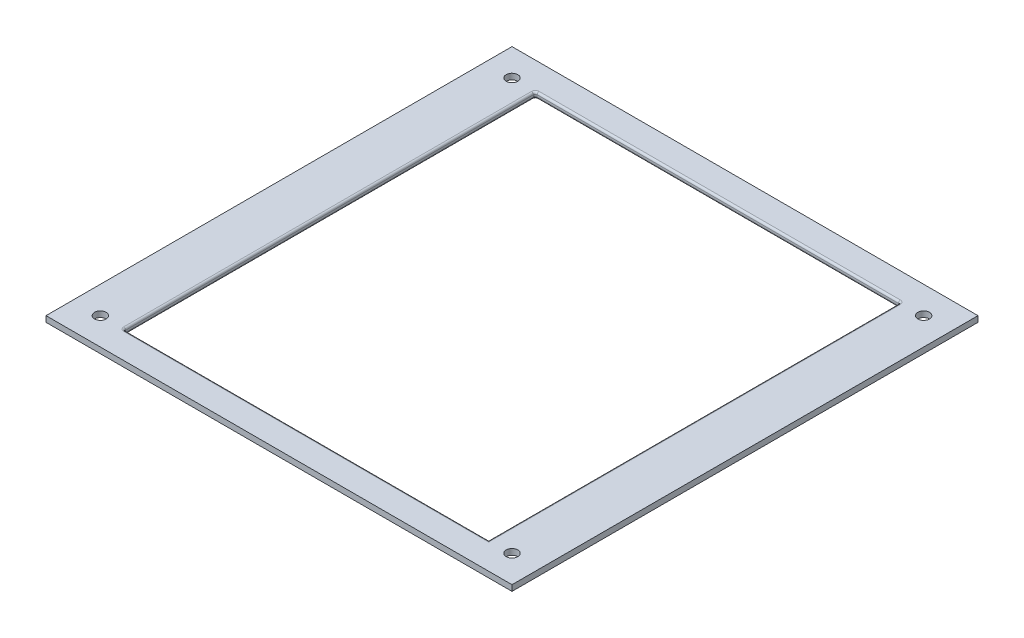
ISO-10303-21;
HEADER;
FILE_DESCRIPTION(('STEP AP214'),'2;1');
FILE_NAME('part.step','',(''),(''),'','','');
FILE_SCHEMA(('AUTOMOTIVE_DESIGN { 1 0 10303 214 1 1 1 1 }'));
ENDSEC;
DATA;
#1=APPLICATION_CONTEXT('core data for automotive mechanical design processes');
#2=APPLICATION_PROTOCOL_DEFINITION('international standard','automotive_design',2000,#1);
#3=PRODUCT_CONTEXT('',#1,'mechanical');
#4=PRODUCT('Part','Part','',(#3));
#5=PRODUCT_RELATED_PRODUCT_CATEGORY('part','',(#4));
#6=PRODUCT_DEFINITION_FORMATION('','',#4);
#7=PRODUCT_DEFINITION_CONTEXT('part definition',#1,'design');
#8=PRODUCT_DEFINITION('design','',#6,#7);
#9=PRODUCT_DEFINITION_SHAPE('','',#8);
#10=(LENGTH_UNIT() NAMED_UNIT(*) SI_UNIT(.MILLI.,.METRE.));
#11=(NAMED_UNIT(*) PLANE_ANGLE_UNIT() SI_UNIT($,.RADIAN.));
#12=(NAMED_UNIT(*) SI_UNIT($,.STERADIAN.) SOLID_ANGLE_UNIT());
#13=UNCERTAINTY_MEASURE_WITH_UNIT(LENGTH_MEASURE(1.E-05),#10,'distance_accuracy_value','');
#14=(GEOMETRIC_REPRESENTATION_CONTEXT(3) GLOBAL_UNCERTAINTY_ASSIGNED_CONTEXT((#13)) GLOBAL_UNIT_ASSIGNED_CONTEXT((#10,
#11,#12)) REPRESENTATION_CONTEXT('',''));
#15=CARTESIAN_POINT('',(0.,0.,0.));
#16=DIRECTION('',(0.,0.,1.));
#17=DIRECTION('',(1.,0.,0.));
#18=AXIS2_PLACEMENT_3D('',#15,#16,#17);
#19=CARTESIAN_POINT('',(0.,0.,0.));
#20=DIRECTION('',(0.,-1.,0.));
#21=DIRECTION('',(0.,0.,-1.));
#22=AXIS2_PLACEMENT_3D('',#19,#20,#21);
#23=PLANE('',#22);
#24=CARTESIAN_POINT('',(52.9999999999986,0.,-52.9999999999986));
#25=DIRECTION('',(0.,1.,0.));
#26=DIRECTION('',(0.,0.,1.));
#27=AXIS2_PLACEMENT_3D('',#24,#25,#26);
#28=CIRCLE('',#27,1.5);
#29=CARTESIAN_POINT('',(52.9999999999986,0.,-51.4999999999986));
#30=VERTEX_POINT('',#29);
#31=EDGE_CURVE('E322',#30,#30,#28,.T.);
#32=ORIENTED_EDGE('',*,*,#31,.T.);
#33=EDGE_LOOP('',(#32));
#34=FACE_BOUND('',#33,.T.);
#35=CARTESIAN_POINT('',(-52.9999999999702,0.,53.0000000000271));
#36=DIRECTION('',(0.,1.,0.));
#37=DIRECTION('',(0.,0.,1.));
#38=AXIS2_PLACEMENT_3D('',#35,#36,#37);
#39=CIRCLE('',#38,1.5);
#40=CARTESIAN_POINT('',(-52.9999999999702,0.,54.5000000000271));
#41=VERTEX_POINT('',#40);
#42=EDGE_CURVE('E321',#41,#41,#39,.T.);
#43=ORIENTED_EDGE('',*,*,#42,.T.);
#44=EDGE_LOOP('',(#43));
#45=FACE_BOUND('',#44,.T.);
#46=CARTESIAN_POINT('',(52.9999999999986,0.,52.9999999999986));
#47=DIRECTION('',(0.,1.,0.));
#48=DIRECTION('',(0.,0.,1.));
#49=AXIS2_PLACEMENT_3D('',#46,#47,#48);
#50=CIRCLE('',#49,1.5);
#51=CARTESIAN_POINT('',(52.9999999999986,0.,54.4999999999986));
#52=VERTEX_POINT('',#51);
#53=EDGE_CURVE('E310',#52,#52,#50,.T.);
#54=ORIENTED_EDGE('',*,*,#53,.T.);
#55=EDGE_LOOP('',(#54));
#56=FACE_BOUND('',#55,.T.);
#57=CARTESIAN_POINT('',(-52.9999999999986,0.,-52.9999999999986));
#58=DIRECTION('',(0.,1.,0.));
#59=DIRECTION('',(0.,0.,1.));
#60=AXIS2_PLACEMENT_3D('',#57,#58,#59);
#61=CIRCLE('',#60,1.5);
#62=CARTESIAN_POINT('',(-52.9999999999986,0.,-51.4999999999986));
#63=VERTEX_POINT('',#62);
#64=EDGE_CURVE('E329',#63,#63,#61,.T.);
#65=ORIENTED_EDGE('',*,*,#64,.T.);
#66=EDGE_LOOP('',(#65));
#67=FACE_BOUND('',#66,.T.);
#68=DIRECTION('',(0.,0.,-1.));
#69=VECTOR('',#68,1.);
#70=CARTESIAN_POINT('',(60.,0.,60.));
#71=LINE('',#70,#69);
#72=CARTESIAN_POINT('',(60.,0.,60.));
#73=VERTEX_POINT('',#72);
#74=CARTESIAN_POINT('',(60.,0.,-60.));
#75=VERTEX_POINT('',#74);
#76=EDGE_CURVE('E183',#73,#75,#71,.T.);
#77=ORIENTED_EDGE('',*,*,#76,.F.);
#78=DIRECTION('',(1.,0.,0.));
#79=VECTOR('',#78,1.);
#80=CARTESIAN_POINT('',(-60.,0.,60.));
#81=LINE('',#80,#79);
#82=CARTESIAN_POINT('',(-60.,0.,60.));
#83=VERTEX_POINT('',#82);
#84=EDGE_CURVE('E179',#83,#73,#81,.T.);
#85=ORIENTED_EDGE('',*,*,#84,.F.);
#86=DIRECTION('',(0.,0.,1.));
#87=VECTOR('',#86,1.);
#88=CARTESIAN_POINT('',(-60.,0.,60.));
#89=LINE('',#88,#87);
#90=CARTESIAN_POINT('',(-60.,0.,-60.));
#91=VERTEX_POINT('',#90);
#92=EDGE_CURVE('E345',#91,#83,#89,.T.);
#93=ORIENTED_EDGE('',*,*,#92,.F.);
#94=DIRECTION('',(-1.,0.,0.));
#95=VECTOR('',#94,1.);
#96=CARTESIAN_POINT('',(-60.,0.,-60.));
#97=LINE('',#96,#95);
#98=EDGE_CURVE('E343',#75,#91,#97,.T.);
#99=ORIENTED_EDGE('',*,*,#98,.F.);
#100=EDGE_LOOP('',(#77,#85,#93,#99));
#101=FACE_BOUND('',#100,.T.);
#102=CARTESIAN_POINT('',(-46.5,0.,52.5));
#103=DIRECTION('',(0.,-1.,0.));
#104=DIRECTION('',(0.,0.,-1.));
#105=AXIS2_PLACEMENT_3D('',#102,#103,#104);
#106=CIRCLE('',#105,1.);
#107=CARTESIAN_POINT('',(-46.5,0.,53.5));
#108=VERTEX_POINT('',#107);
#109=CARTESIAN_POINT('',(-47.5,0.,52.5));
#110=VERTEX_POINT('',#109);
#111=EDGE_CURVE('E229',#108,#110,#106,.T.);
#112=ORIENTED_EDGE('',*,*,#111,.F.);
#113=DIRECTION('',(1.,0.,0.));
#114=VECTOR('',#113,1.);
#115=CARTESIAN_POINT('',(0.,0.,53.5));
#116=LINE('',#115,#114);
#117=CARTESIAN_POINT('',(47.499999999997,0.,53.5));
#118=VERTEX_POINT('',#117);
#119=EDGE_CURVE('E226',#108,#118,#116,.T.);
#120=ORIENTED_EDGE('',*,*,#119,.T.);
#121=DIRECTION('',(0.,0.,-1.));
#122=VECTOR('',#121,1.);
#123=CARTESIAN_POINT('',(47.4999999999985,0.,1.32460866175055E-12));
#124=LINE('',#123,#122);
#125=CARTESIAN_POINT('',(47.5,0.,-52.5));
#126=VERTEX_POINT('',#125);
#127=EDGE_CURVE('E224',#118,#126,#124,.T.);
#128=ORIENTED_EDGE('',*,*,#127,.T.);
#129=CARTESIAN_POINT('',(46.5,0.,-52.5));
#130=DIRECTION('',(0.,-1.,0.));
#131=DIRECTION('',(0.,0.,-1.));
#132=AXIS2_PLACEMENT_3D('',#129,#130,#131);
#133=CIRCLE('',#132,1.);
#134=CARTESIAN_POINT('',(46.5,0.,-53.5));
#135=VERTEX_POINT('',#134);
#136=EDGE_CURVE('E221',#135,#126,#133,.T.);
#137=ORIENTED_EDGE('',*,*,#136,.F.);
#138=DIRECTION('',(-1.,0.,0.));
#139=VECTOR('',#138,1.);
#140=CARTESIAN_POINT('',(0.,0.,-53.5));
#141=LINE('',#140,#139);
#142=CARTESIAN_POINT('',(-46.4999999999971,0.,-53.5));
#143=VERTEX_POINT('',#142);
#144=EDGE_CURVE('E217',#135,#143,#141,.T.);
#145=ORIENTED_EDGE('',*,*,#144,.T.);
#146=CARTESIAN_POINT('',(-46.4999999999971,0.,-52.5));
#147=DIRECTION('',(0.,-1.,0.));
#148=DIRECTION('',(0.,0.,-1.));
#149=AXIS2_PLACEMENT_3D('',#146,#147,#148);
#150=CIRCLE('',#149,1.);
#151=CARTESIAN_POINT('',(-47.4999999999971,0.,-52.5));
#152=VERTEX_POINT('',#151);
#153=EDGE_CURVE('E214',#152,#143,#150,.T.);
#154=ORIENTED_EDGE('',*,*,#153,.F.);
#155=DIRECTION('',(0.,0.,1.));
#156=VECTOR('',#155,1.);
#157=CARTESIAN_POINT('',(-47.4999999999985,0.,-1.31838984174233E-12));
#158=LINE('',#157,#156);
#159=EDGE_CURVE('E219',#152,#110,#158,.T.);
#160=ORIENTED_EDGE('',*,*,#159,.T.);
#161=EDGE_LOOP('',(#112,#120,#128,#137,#145,#154,#160));
#162=FACE_BOUND('',#161,.T.);
#163=ADVANCED_FACE('F33',(#34,#45,#56,#67,#101,#162),#23,.T.);
#164=CARTESIAN_POINT('',(0.,1.5,0.));
#165=DIRECTION('',(0.,-1.,0.));
#166=DIRECTION('',(0.,0.,-1.));
#167=AXIS2_PLACEMENT_3D('',#164,#165,#166);
#168=PLANE('',#167);
#169=DIRECTION('',(0.,0.,1.));
#170=VECTOR('',#169,1.);
#171=CARTESIAN_POINT('',(47.499999999997,1.5,53.));
#172=LINE('',#171,#170);
#173=CARTESIAN_POINT('',(47.5,1.5,-52.5));
#174=VERTEX_POINT('',#173);
#175=CARTESIAN_POINT('',(47.499999999997,1.5,53.5));
#176=VERTEX_POINT('',#175);
#177=EDGE_CURVE('E199',#174,#176,#172,.T.);
#178=ORIENTED_EDGE('',*,*,#177,.T.);
#179=DIRECTION('',(-1.,0.,0.));
#180=VECTOR('',#179,1.);
#181=CARTESIAN_POINT('',(-47.,1.5,53.5));
#182=LINE('',#181,#180);
#183=CARTESIAN_POINT('',(-46.5,1.5,53.5));
#184=VERTEX_POINT('',#183);
#185=EDGE_CURVE('E204',#176,#184,#182,.T.);
#186=ORIENTED_EDGE('',*,*,#185,.T.);
#187=CARTESIAN_POINT('',(-46.5,1.5,52.5));
#188=DIRECTION('',(0.,-1.,0.));
#189=DIRECTION('',(0.,0.,-1.));
#190=AXIS2_PLACEMENT_3D('',#187,#188,#189);
#191=CIRCLE('',#190,1.);
#192=CARTESIAN_POINT('',(-47.5,1.5,52.5));
#193=VERTEX_POINT('',#192);
#194=EDGE_CURVE('E201',#193,#184,#191,.F.);
#195=ORIENTED_EDGE('',*,*,#194,.F.);
#196=DIRECTION('',(0.,0.,-1.));
#197=VECTOR('',#196,1.);
#198=CARTESIAN_POINT('',(-47.499999999997,1.5,-53.));
#199=LINE('',#198,#197);
#200=CARTESIAN_POINT('',(-47.4999999999971,1.5,-52.5));
#201=VERTEX_POINT('',#200);
#202=EDGE_CURVE('E197',#193,#201,#199,.T.);
#203=ORIENTED_EDGE('',*,*,#202,.T.);
#204=CARTESIAN_POINT('',(-46.4999999999971,1.5,-52.5));
#205=DIRECTION('',(0.,-1.,0.));
#206=DIRECTION('',(0.,0.,-1.));
#207=AXIS2_PLACEMENT_3D('',#204,#205,#206);
#208=CIRCLE('',#207,1.);
#209=CARTESIAN_POINT('',(-46.4999999999971,1.5,-53.5));
#210=VERTEX_POINT('',#209);
#211=EDGE_CURVE('E194',#210,#201,#208,.F.);
#212=ORIENTED_EDGE('',*,*,#211,.F.);
#213=DIRECTION('',(1.,0.,0.));
#214=VECTOR('',#213,1.);
#215=CARTESIAN_POINT('',(47.,1.5,-53.5));
#216=LINE('',#215,#214);
#217=CARTESIAN_POINT('',(46.5,1.5,-53.5));
#218=VERTEX_POINT('',#217);
#219=EDGE_CURVE('E187',#210,#218,#216,.T.);
#220=ORIENTED_EDGE('',*,*,#219,.T.);
#221=CARTESIAN_POINT('',(46.5,1.5,-52.5));
#222=DIRECTION('',(0.,-1.,0.));
#223=DIRECTION('',(0.,0.,-1.));
#224=AXIS2_PLACEMENT_3D('',#221,#222,#223);
#225=CIRCLE('',#224,1.);
#226=EDGE_CURVE('E184',#174,#218,#225,.F.);
#227=ORIENTED_EDGE('',*,*,#226,.F.);
#228=EDGE_LOOP('',(#178,#186,#195,#203,#212,#220,#227));
#229=FACE_BOUND('',#228,.T.);
#230=DIRECTION('',(0.,0.,-1.));
#231=VECTOR('',#230,1.);
#232=CARTESIAN_POINT('',(60.,1.5,60.));
#233=LINE('',#232,#231);
#234=CARTESIAN_POINT('',(60.,1.5,60.));
#235=VERTEX_POINT('',#234);
#236=CARTESIAN_POINT('',(60.,1.5,-60.));
#237=VERTEX_POINT('',#236);
#238=EDGE_CURVE('E169',#235,#237,#233,.T.);
#239=ORIENTED_EDGE('',*,*,#238,.T.);
#240=DIRECTION('',(-1.,0.,0.));
#241=VECTOR('',#240,1.);
#242=CARTESIAN_POINT('',(-60.,1.5,-60.));
#243=LINE('',#242,#241);
#244=CARTESIAN_POINT('',(-60.,1.5,-60.));
#245=VERTEX_POINT('',#244);
#246=EDGE_CURVE('E158',#237,#245,#243,.T.);
#247=ORIENTED_EDGE('',*,*,#246,.T.);
#248=DIRECTION('',(0.,0.,1.));
#249=VECTOR('',#248,1.);
#250=CARTESIAN_POINT('',(-60.,1.5,60.));
#251=LINE('',#250,#249);
#252=CARTESIAN_POINT('',(-60.,1.5,60.));
#253=VERTEX_POINT('',#252);
#254=EDGE_CURVE('E168',#245,#253,#251,.T.);
#255=ORIENTED_EDGE('',*,*,#254,.T.);
#256=DIRECTION('',(1.,0.,0.));
#257=VECTOR('',#256,1.);
#258=CARTESIAN_POINT('',(-60.,1.5,60.));
#259=LINE('',#258,#257);
#260=EDGE_CURVE('E175',#253,#235,#259,.T.);
#261=ORIENTED_EDGE('',*,*,#260,.T.);
#262=EDGE_LOOP('',(#239,#247,#255,#261));
#263=FACE_BOUND('',#262,.T.);
#264=CARTESIAN_POINT('',(-52.9999999999986,1.5,-52.9999999999986));
#265=DIRECTION('',(0.,-1.,0.));
#266=DIRECTION('',(0.,0.,-1.));
#267=AXIS2_PLACEMENT_3D('',#264,#265,#266);
#268=CIRCLE('',#267,1.5);
#269=CARTESIAN_POINT('',(-52.9999999999986,1.5,-54.4999999999986));
#270=VERTEX_POINT('',#269);
#271=EDGE_CURVE('E336',#270,#270,#268,.T.);
#272=ORIENTED_EDGE('',*,*,#271,.T.);
#273=EDGE_LOOP('',(#272));
#274=FACE_BOUND('',#273,.T.);
#275=CARTESIAN_POINT('',(52.9999999999986,1.5,52.9999999999986));
#276=DIRECTION('',(0.,-1.,0.));
#277=DIRECTION('',(0.,0.,-1.));
#278=AXIS2_PLACEMENT_3D('',#275,#276,#277);
#279=CIRCLE('',#278,1.5);
#280=CARTESIAN_POINT('',(52.9999999999986,1.5,51.4999999999986));
#281=VERTEX_POINT('',#280);
#282=EDGE_CURVE('E316',#281,#281,#279,.T.);
#283=ORIENTED_EDGE('',*,*,#282,.T.);
#284=EDGE_LOOP('',(#283));
#285=FACE_BOUND('',#284,.T.);
#286=CARTESIAN_POINT('',(-52.9999999999702,1.5,53.0000000000271));
#287=DIRECTION('',(0.,-1.,0.));
#288=DIRECTION('',(0.,0.,-1.));
#289=AXIS2_PLACEMENT_3D('',#286,#287,#288);
#290=CIRCLE('',#289,1.5);
#291=CARTESIAN_POINT('',(-52.9999999999702,1.5,51.5000000000271));
#292=VERTEX_POINT('',#291);
#293=EDGE_CURVE('E326',#292,#292,#290,.T.);
#294=ORIENTED_EDGE('',*,*,#293,.T.);
#295=EDGE_LOOP('',(#294));
#296=FACE_BOUND('',#295,.T.);
#297=CARTESIAN_POINT('',(52.9999999999986,1.5,-52.9999999999986));
#298=DIRECTION('',(0.,-1.,0.));
#299=DIRECTION('',(0.,0.,-1.));
#300=AXIS2_PLACEMENT_3D('',#297,#298,#299);
#301=CIRCLE('',#300,1.5);
#302=CARTESIAN_POINT('',(52.9999999999986,1.5,-54.4999999999986));
#303=VERTEX_POINT('',#302);
#304=EDGE_CURVE('E325',#303,#303,#301,.T.);
#305=ORIENTED_EDGE('',*,*,#304,.T.);
#306=EDGE_LOOP('',(#305));
#307=FACE_BOUND('',#306,.T.);
#308=ADVANCED_FACE('F172',(#229,#263,#274,#285,#296,#307),#168,.F.);
#309=CARTESIAN_POINT('',(60.,1.5,60.));
#310=DIRECTION('',(-1.,0.,0.));
#311=DIRECTION('',(0.,0.,1.));
#312=AXIS2_PLACEMENT_3D('',#309,#310,#311);
#313=PLANE('',#312);
#314=ORIENTED_EDGE('',*,*,#76,.T.);
#315=DIRECTION('',(0.,-1.,0.));
#316=VECTOR('',#315,1.);
#317=CARTESIAN_POINT('',(60.,1.5,-60.));
#318=LINE('',#317,#316);
#319=EDGE_CURVE('E162',#237,#75,#318,.T.);
#320=ORIENTED_EDGE('',*,*,#319,.F.);
#321=ORIENTED_EDGE('',*,*,#238,.F.);
#322=DIRECTION('',(0.,-1.,0.));
#323=VECTOR('',#322,1.);
#324=CARTESIAN_POINT('',(60.,1.5,60.));
#325=LINE('',#324,#323);
#326=EDGE_CURVE('E341',#235,#73,#325,.T.);
#327=ORIENTED_EDGE('',*,*,#326,.T.);
#328=EDGE_LOOP('',(#314,#320,#321,#327));
#329=FACE_BOUND('',#328,.T.);
#330=ADVANCED_FACE('F181',(#329),#313,.F.);
#331=CARTESIAN_POINT('',(-60.,1.5,-60.));
#332=DIRECTION('',(0.,0.,1.));
#333=DIRECTION('',(1.,0.,0.));
#334=AXIS2_PLACEMENT_3D('',#331,#332,#333);
#335=PLANE('',#334);
#336=ORIENTED_EDGE('',*,*,#98,.T.);
#337=DIRECTION('',(0.,-1.,0.));
#338=VECTOR('',#337,1.);
#339=CARTESIAN_POINT('',(-60.,1.5,-60.));
#340=LINE('',#339,#338);
#341=EDGE_CURVE('E165',#245,#91,#340,.T.);
#342=ORIENTED_EDGE('',*,*,#341,.F.);
#343=ORIENTED_EDGE('',*,*,#246,.F.);
#344=ORIENTED_EDGE('',*,*,#319,.T.);
#345=EDGE_LOOP('',(#336,#342,#343,#344));
#346=FACE_BOUND('',#345,.T.);
#347=ADVANCED_FACE('F160',(#346),#335,.F.);
#348=CARTESIAN_POINT('',(-60.,1.5,60.));
#349=DIRECTION('',(1.,0.,0.));
#350=DIRECTION('',(0.,0.,-1.));
#351=AXIS2_PLACEMENT_3D('',#348,#349,#350);
#352=PLANE('',#351);
#353=ORIENTED_EDGE('',*,*,#92,.T.);
#354=DIRECTION('',(0.,-1.,0.));
#355=VECTOR('',#354,1.);
#356=CARTESIAN_POINT('',(-60.,1.5,60.));
#357=LINE('',#356,#355);
#358=EDGE_CURVE('E189',#253,#83,#357,.T.);
#359=ORIENTED_EDGE('',*,*,#358,.F.);
#360=ORIENTED_EDGE('',*,*,#254,.F.);
#361=ORIENTED_EDGE('',*,*,#341,.T.);
#362=EDGE_LOOP('',(#353,#359,#360,#361));
#363=FACE_BOUND('',#362,.T.);
#364=ADVANCED_FACE('F357',(#363),#352,.F.);
#365=CARTESIAN_POINT('',(-60.,1.5,60.));
#366=DIRECTION('',(0.,0.,-1.));
#367=DIRECTION('',(-1.,0.,0.));
#368=AXIS2_PLACEMENT_3D('',#365,#366,#367);
#369=PLANE('',#368);
#370=ORIENTED_EDGE('',*,*,#84,.T.);
#371=ORIENTED_EDGE('',*,*,#326,.F.);
#372=ORIENTED_EDGE('',*,*,#260,.F.);
#373=ORIENTED_EDGE('',*,*,#358,.T.);
#374=EDGE_LOOP('',(#370,#371,#372,#373));
#375=FACE_BOUND('',#374,.T.);
#376=ADVANCED_FACE('F352',(#375),#369,.F.);
#377=CARTESIAN_POINT('',(-52.9999999999986,5.74264068711929,-52.9999999999986));
#378=DIRECTION('',(0.,-1.,0.));
#379=DIRECTION('',(0.,0.,-1.));
#380=AXIS2_PLACEMENT_3D('',#377,#378,#379);
#381=CYLINDRICAL_SURFACE('',#380,1.5);
#382=ORIENTED_EDGE('',*,*,#271,.F.);
#383=EDGE_LOOP('',(#382));
#384=FACE_BOUND('',#383,.T.);
#385=ORIENTED_EDGE('',*,*,#64,.F.);
#386=EDGE_LOOP('',(#385));
#387=FACE_BOUND('',#386,.T.);
#388=ADVANCED_FACE('F364',(#384,#387),#381,.F.);
#389=CARTESIAN_POINT('',(52.9999999999986,5.74264068711929,52.9999999999986));
#390=DIRECTION('',(0.,-1.,0.));
#391=DIRECTION('',(0.,0.,-1.));
#392=AXIS2_PLACEMENT_3D('',#389,#390,#391);
#393=CYLINDRICAL_SURFACE('',#392,1.5);
#394=ORIENTED_EDGE('',*,*,#282,.F.);
#395=EDGE_LOOP('',(#394));
#396=FACE_BOUND('',#395,.T.);
#397=ORIENTED_EDGE('',*,*,#53,.F.);
#398=EDGE_LOOP('',(#397));
#399=FACE_BOUND('',#398,.T.);
#400=ADVANCED_FACE('F379',(#396,#399),#393,.F.);
#401=CARTESIAN_POINT('',(-52.9999999999702,5.74264068711929,53.0000000000271));
#402=DIRECTION('',(0.,-1.,0.));
#403=DIRECTION('',(0.,0.,-1.));
#404=AXIS2_PLACEMENT_3D('',#401,#402,#403);
#405=CYLINDRICAL_SURFACE('',#404,1.5);
#406=ORIENTED_EDGE('',*,*,#293,.F.);
#407=EDGE_LOOP('',(#406));
#408=FACE_BOUND('',#407,.T.);
#409=ORIENTED_EDGE('',*,*,#42,.F.);
#410=EDGE_LOOP('',(#409));
#411=FACE_BOUND('',#410,.T.);
#412=ADVANCED_FACE('F381',(#408,#411),#405,.F.);
#413=CARTESIAN_POINT('',(52.9999999999986,5.74264068711929,-52.9999999999986));
#414=DIRECTION('',(0.,-1.,0.));
#415=DIRECTION('',(0.,0.,-1.));
#416=AXIS2_PLACEMENT_3D('',#413,#414,#415);
#417=CYLINDRICAL_SURFACE('',#416,1.5);
#418=ORIENTED_EDGE('',*,*,#304,.F.);
#419=EDGE_LOOP('',(#418));
#420=FACE_BOUND('',#419,.T.);
#421=ORIENTED_EDGE('',*,*,#31,.F.);
#422=EDGE_LOOP('',(#421));
#423=FACE_BOUND('',#422,.T.);
#424=ADVANCED_FACE('F384',(#420,#423),#417,.F.);
#425=CARTESIAN_POINT('',(-46.999999999997,143.175685987399,-53.));
#426=DIRECTION('',(0.,0.,1.));
#427=DIRECTION('',(1.,0.,0.));
#428=AXIS2_PLACEMENT_3D('',#425,#426,#427);
#429=PLANE('',#428);
#430=DIRECTION('',(0.,-1.,0.));
#431=VECTOR('',#430,1.);
#432=CARTESIAN_POINT('',(46.5,1.5,-53.));
#433=LINE('',#432,#431);
#434=CARTESIAN_POINT('',(46.5,0.5,-53.));
#435=VERTEX_POINT('',#434);
#436=CARTESIAN_POINT('',(46.5,1.,-53.));
#437=VERTEX_POINT('',#436);
#438=EDGE_CURVE('E42',#435,#437,#433,.F.);
#439=ORIENTED_EDGE('',*,*,#438,.T.);
#440=DIRECTION('',(1.,0.,0.));
#441=VECTOR('',#440,1.);
#442=CARTESIAN_POINT('',(-46.999999999997,1.,-53.));
#443=LINE('',#442,#441);
#444=CARTESIAN_POINT('',(-46.4999999999971,1.,-53.));
#445=VERTEX_POINT('',#444);
#446=EDGE_CURVE('E11',#437,#445,#443,.F.);
#447=ORIENTED_EDGE('',*,*,#446,.T.);
#448=DIRECTION('',(0.,-1.,0.));
#449=VECTOR('',#448,1.);
#450=CARTESIAN_POINT('',(-46.4999999999971,0.,-53.));
#451=LINE('',#450,#449);
#452=CARTESIAN_POINT('',(-46.4999999999971,0.5,-53.));
#453=VERTEX_POINT('',#452);
#454=EDGE_CURVE('E247',#445,#453,#451,.T.);
#455=ORIENTED_EDGE('',*,*,#454,.T.);
#456=DIRECTION('',(-1.,0.,0.));
#457=VECTOR('',#456,1.);
#458=CARTESIAN_POINT('',(-46.999999999997,0.5,-53.));
#459=LINE('',#458,#457);
#460=EDGE_CURVE('E53',#453,#435,#459,.F.);
#461=ORIENTED_EDGE('',*,*,#460,.T.);
#462=EDGE_LOOP('',(#439,#447,#455,#461));
#463=FACE_BOUND('',#462,.T.);
#464=ADVANCED_FACE('F388',(#463),#429,.T.);
#465=CARTESIAN_POINT('',(47.,143.175685987399,-53.));
#466=DIRECTION('',(-1.,0.,0.));
#467=DIRECTION('',(0.,0.,1.));
#468=AXIS2_PLACEMENT_3D('',#465,#466,#467);
#469=PLANE('',#468);
#470=DIRECTION('',(0.,-1.,0.));
#471=VECTOR('',#470,1.);
#472=CARTESIAN_POINT('',(46.999999999997,143.175685987399,53.));
#473=LINE('',#472,#471);
#474=CARTESIAN_POINT('',(46.999999999997,1.,53.));
#475=VERTEX_POINT('',#474);
#476=CARTESIAN_POINT('',(46.999999999997,0.5,53.));
#477=VERTEX_POINT('',#476);
#478=EDGE_CURVE('E305',#475,#477,#473,.T.);
#479=ORIENTED_EDGE('',*,*,#478,.F.);
#480=DIRECTION('',(0.,0.,1.));
#481=VECTOR('',#480,1.);
#482=CARTESIAN_POINT('',(47.,1.,-53.));
#483=LINE('',#482,#481);
#484=CARTESIAN_POINT('',(47.,1.,-52.5));
#485=VERTEX_POINT('',#484);
#486=EDGE_CURVE('E236',#475,#485,#483,.F.);
#487=ORIENTED_EDGE('',*,*,#486,.T.);
#488=DIRECTION('',(0.,-1.,0.));
#489=VECTOR('',#488,1.);
#490=CARTESIAN_POINT('',(47.,0.,-52.5));
#491=LINE('',#490,#489);
#492=CARTESIAN_POINT('',(47.,0.5,-52.5));
#493=VERTEX_POINT('',#492);
#494=EDGE_CURVE('E232',#485,#493,#491,.T.);
#495=ORIENTED_EDGE('',*,*,#494,.T.);
#496=DIRECTION('',(0.,0.,-1.));
#497=VECTOR('',#496,1.);
#498=CARTESIAN_POINT('',(47.,0.5,-53.));
#499=LINE('',#498,#497);
#500=EDGE_CURVE('E234',#493,#477,#499,.F.);
#501=ORIENTED_EDGE('',*,*,#500,.T.);
#502=EDGE_LOOP('',(#479,#487,#495,#501));
#503=FACE_BOUND('',#502,.T.);
#504=ADVANCED_FACE('F400',(#503),#469,.T.);
#505=CARTESIAN_POINT('',(-47.,143.175685987399,53.));
#506=DIRECTION('',(0.,0.,-1.));
#507=DIRECTION('',(-1.,0.,0.));
#508=AXIS2_PLACEMENT_3D('',#505,#506,#507);
#509=PLANE('',#508);
#510=DIRECTION('',(0.,-1.,0.));
#511=VECTOR('',#510,1.);
#512=CARTESIAN_POINT('',(-46.5,1.5,53.));
#513=LINE('',#512,#511);
#514=CARTESIAN_POINT('',(-46.5,0.5,53.));
#515=VERTEX_POINT('',#514);
#516=CARTESIAN_POINT('',(-46.5,1.,53.));
#517=VERTEX_POINT('',#516);
#518=EDGE_CURVE('E207',#515,#517,#513,.F.);
#519=ORIENTED_EDGE('',*,*,#518,.T.);
#520=DIRECTION('',(-1.,0.,0.));
#521=VECTOR('',#520,1.);
#522=CARTESIAN_POINT('',(46.999999999997,1.,53.));
#523=LINE('',#522,#521);
#524=EDGE_CURVE('E211',#517,#475,#523,.F.);
#525=ORIENTED_EDGE('',*,*,#524,.T.);
#526=ORIENTED_EDGE('',*,*,#478,.T.);
#527=DIRECTION('',(1.,0.,0.));
#528=VECTOR('',#527,1.);
#529=CARTESIAN_POINT('',(-47.,0.5,53.));
#530=LINE('',#529,#528);
#531=EDGE_CURVE('E209',#477,#515,#530,.F.);
#532=ORIENTED_EDGE('',*,*,#531,.T.);
#533=EDGE_LOOP('',(#519,#525,#526,#532));
#534=FACE_BOUND('',#533,.T.);
#535=ADVANCED_FACE('F396',(#534),#509,.T.);
#536=CARTESIAN_POINT('',(-46.999999999997,143.175685987399,-53.));
#537=DIRECTION('',(1.,0.,0.));
#538=DIRECTION('',(0.,0.,-1.));
#539=AXIS2_PLACEMENT_3D('',#536,#537,#538);
#540=PLANE('',#539);
#541=DIRECTION('',(0.,0.,-1.));
#542=VECTOR('',#541,1.);
#543=CARTESIAN_POINT('',(-47.,1.,53.));
#544=LINE('',#543,#542);
#545=CARTESIAN_POINT('',(-46.9999999999971,1.,-52.5));
#546=VERTEX_POINT('',#545);
#547=CARTESIAN_POINT('',(-47.,1.,52.5));
#548=VERTEX_POINT('',#547);
#549=EDGE_CURVE('E242',#546,#548,#544,.F.);
#550=ORIENTED_EDGE('',*,*,#549,.T.);
#551=DIRECTION('',(0.,-1.,0.));
#552=VECTOR('',#551,1.);
#553=CARTESIAN_POINT('',(-47.,0.,52.5));
#554=LINE('',#553,#552);
#555=CARTESIAN_POINT('',(-47.,0.5,52.5));
#556=VERTEX_POINT('',#555);
#557=EDGE_CURVE('E245',#548,#556,#554,.T.);
#558=ORIENTED_EDGE('',*,*,#557,.T.);
#559=DIRECTION('',(0.,0.,1.));
#560=VECTOR('',#559,1.);
#561=CARTESIAN_POINT('',(-46.999999999997,0.5,-53.));
#562=LINE('',#561,#560);
#563=CARTESIAN_POINT('',(-46.9999999999971,0.5,-52.5));
#564=VERTEX_POINT('',#563);
#565=EDGE_CURVE('E240',#556,#564,#562,.F.);
#566=ORIENTED_EDGE('',*,*,#565,.T.);
#567=DIRECTION('',(0.,-1.,0.));
#568=VECTOR('',#567,1.);
#569=CARTESIAN_POINT('',(-46.9999999999971,1.5,-52.5));
#570=LINE('',#569,#568);
#571=EDGE_CURVE('E238',#564,#546,#570,.F.);
#572=ORIENTED_EDGE('',*,*,#571,.T.);
#573=EDGE_LOOP('',(#550,#558,#566,#572));
#574=FACE_BOUND('',#573,.T.);
#575=ADVANCED_FACE('F393',(#574),#540,.T.);
#576=CARTESIAN_POINT('',(0.,0.5,-53.5));
#577=DIRECTION('',(-1.,0.,0.));
#578=DIRECTION('',(0.,0.,1.));
#579=AXIS2_PLACEMENT_3D('',#576,#577,#578);
#580=CYLINDRICAL_SURFACE('',#579,0.5);
#581=CARTESIAN_POINT('',(-46.4999999999971,0.5,-53.5));
#582=DIRECTION('',(-1.,0.,0.));
#583=DIRECTION('',(0.,0.,1.));
#584=AXIS2_PLACEMENT_3D('',#581,#582,#583);
#585=CIRCLE('',#584,0.5);
#586=EDGE_CURVE('E37',#143,#453,#585,.T.);
#587=ORIENTED_EDGE('',*,*,#586,.F.);
#588=ORIENTED_EDGE('',*,*,#144,.F.);
#589=CARTESIAN_POINT('',(46.5,0.5,-53.5));
#590=DIRECTION('',(1.,0.,0.));
#591=DIRECTION('',(0.,0.,-1.));
#592=AXIS2_PLACEMENT_3D('',#589,#590,#591);
#593=CIRCLE('',#592,0.5);
#594=EDGE_CURVE('E297',#435,#135,#593,.T.);
#595=ORIENTED_EDGE('',*,*,#594,.F.);
#596=ORIENTED_EDGE('',*,*,#460,.F.);
#597=EDGE_LOOP('',(#587,#588,#595,#596));
#598=FACE_BOUND('',#597,.T.);
#599=ADVANCED_FACE('F35',(#598),#580,.T.);
#600=CARTESIAN_POINT('',(-46.4999999999971,0.5,-52.5));
#601=DIRECTION('',(0.,-1.,0.));
#602=DIRECTION('',(0.,0.,-1.));
#603=AXIS2_PLACEMENT_3D('',#600,#601,#602);
#604=TOROIDAL_SURFACE('',#603,1.,0.5);
#605=ORIENTED_EDGE('',*,*,#153,.T.);
#606=ORIENTED_EDGE('',*,*,#586,.T.);
#607=CARTESIAN_POINT('',(-46.4999999999971,0.5,-52.5));
#608=DIRECTION('',(0.,-1.,0.));
#609=DIRECTION('',(0.,0.,-1.));
#610=AXIS2_PLACEMENT_3D('',#607,#608,#609);
#611=CIRCLE('',#610,0.5);
#612=EDGE_CURVE('E294',#564,#453,#611,.T.);
#613=ORIENTED_EDGE('',*,*,#612,.F.);
#614=CARTESIAN_POINT('',(-47.4999999999971,0.5,-52.5));
#615=DIRECTION('',(0.,0.,-1.));
#616=DIRECTION('',(-1.,0.,0.));
#617=AXIS2_PLACEMENT_3D('',#614,#615,#616);
#618=CIRCLE('',#617,0.5);
#619=EDGE_CURVE('E291',#152,#564,#618,.F.);
#620=ORIENTED_EDGE('',*,*,#619,.F.);
#621=EDGE_LOOP('',(#605,#606,#613,#620));
#622=FACE_BOUND('',#621,.T.);
#623=ADVANCED_FACE('F428',(#622),#604,.T.);
#624=CARTESIAN_POINT('',(47.4999999999985,0.5,1.32460866175055E-12));
#625=DIRECTION('',(0.,0.,-1.));
#626=DIRECTION('',(-1.,0.,0.));
#627=AXIS2_PLACEMENT_3D('',#624,#625,#626);
#628=CYLINDRICAL_SURFACE('',#627,0.5);
#629=CARTESIAN_POINT('',(47.5,0.5,-52.5));
#630=DIRECTION('',(0.,0.,-1.));
#631=DIRECTION('',(-1.,0.,0.));
#632=AXIS2_PLACEMENT_3D('',#629,#630,#631);
#633=CIRCLE('',#632,0.5);
#634=EDGE_CURVE('E299',#126,#493,#633,.T.);
#635=ORIENTED_EDGE('',*,*,#634,.F.);
#636=ORIENTED_EDGE('',*,*,#127,.F.);
#637=CARTESIAN_POINT('',(47.499999999997,0.5,53.5));
#638=DIRECTION('',(0.707106781186557,0.,-0.707106781186538));
#639=DIRECTION('',(0.707106781186538,0.,0.707106781186557));
#640=AXIS2_PLACEMENT_3D('',#637,#638,#639);
#641=ELLIPSE('',#640,0.707106781186538,0.5);
#642=EDGE_CURVE('E289',#477,#118,#641,.F.);
#643=ORIENTED_EDGE('',*,*,#642,.F.);
#644=ORIENTED_EDGE('',*,*,#500,.F.);
#645=EDGE_LOOP('',(#635,#636,#643,#644));
#646=FACE_BOUND('',#645,.T.);
#647=ADVANCED_FACE('F435',(#646),#628,.T.);
#648=CARTESIAN_POINT('',(46.5,0.5,-52.5));
#649=DIRECTION('',(0.,-1.,0.));
#650=DIRECTION('',(0.,0.,-1.));
#651=AXIS2_PLACEMENT_3D('',#648,#649,#650);
#652=TOROIDAL_SURFACE('',#651,1.,0.5);
#653=ORIENTED_EDGE('',*,*,#136,.T.);
#654=ORIENTED_EDGE('',*,*,#634,.T.);
#655=CARTESIAN_POINT('',(46.5,0.5,-52.5));
#656=DIRECTION('',(0.,-1.,0.));
#657=DIRECTION('',(0.,0.,-1.));
#658=AXIS2_PLACEMENT_3D('',#655,#656,#657);
#659=CIRCLE('',#658,0.5);
#660=EDGE_CURVE('E286',#435,#493,#659,.T.);
#661=ORIENTED_EDGE('',*,*,#660,.F.);
#662=ORIENTED_EDGE('',*,*,#594,.T.);
#663=EDGE_LOOP('',(#653,#654,#661,#662));
#664=FACE_BOUND('',#663,.T.);
#665=ADVANCED_FACE('F441',(#664),#652,.T.);
#666=CARTESIAN_POINT('',(-46.4999999999971,143.175685987399,-52.5));
#667=DIRECTION('',(0.,1.,0.));
#668=DIRECTION('',(0.,0.,1.));
#669=AXIS2_PLACEMENT_3D('',#666,#667,#668);
#670=CYLINDRICAL_SURFACE('',#669,0.5);
#671=ORIENTED_EDGE('',*,*,#612,.T.);
#672=ORIENTED_EDGE('',*,*,#454,.F.);
#673=CARTESIAN_POINT('',(-46.4999999999971,1.,-52.5));
#674=DIRECTION('',(0.,-1.,0.));
#675=DIRECTION('',(0.,0.,-1.));
#676=AXIS2_PLACEMENT_3D('',#673,#674,#675);
#677=CIRCLE('',#676,0.5);
#678=EDGE_CURVE('E281',#546,#445,#677,.T.);
#679=ORIENTED_EDGE('',*,*,#678,.F.);
#680=ORIENTED_EDGE('',*,*,#571,.F.);
#681=EDGE_LOOP('',(#671,#672,#679,#680));
#682=FACE_BOUND('',#681,.T.);
#683=ADVANCED_FACE('F449',(#682),#670,.F.);
#684=CARTESIAN_POINT('',(-47.4999999999985,0.5,-1.31838984174233E-12));
#685=DIRECTION('',(0.,0.,1.));
#686=DIRECTION('',(1.,0.,0.));
#687=AXIS2_PLACEMENT_3D('',#684,#685,#686);
#688=CYLINDRICAL_SURFACE('',#687,0.5);
#689=ORIENTED_EDGE('',*,*,#619,.T.);
#690=ORIENTED_EDGE('',*,*,#565,.F.);
#691=CARTESIAN_POINT('',(-47.5,0.5,52.5));
#692=DIRECTION('',(0.,0.,1.));
#693=DIRECTION('',(1.,0.,0.));
#694=AXIS2_PLACEMENT_3D('',#691,#692,#693);
#695=CIRCLE('',#694,0.5);
#696=EDGE_CURVE('E278',#110,#556,#695,.T.);
#697=ORIENTED_EDGE('',*,*,#696,.F.);
#698=ORIENTED_EDGE('',*,*,#159,.F.);
#699=EDGE_LOOP('',(#689,#690,#697,#698));
#700=FACE_BOUND('',#699,.T.);
#701=ADVANCED_FACE('F456',(#700),#688,.T.);
#702=CARTESIAN_POINT('',(0.,0.5,53.5));
#703=DIRECTION('',(1.,0.,0.));
#704=DIRECTION('',(0.,0.,-1.));
#705=AXIS2_PLACEMENT_3D('',#702,#703,#704);
#706=CYLINDRICAL_SURFACE('',#705,0.5);
#707=ORIENTED_EDGE('',*,*,#642,.T.);
#708=ORIENTED_EDGE('',*,*,#119,.F.);
#709=CARTESIAN_POINT('',(-46.5,0.5,53.5));
#710=DIRECTION('',(-1.,0.,0.));
#711=DIRECTION('',(0.,0.,1.));
#712=AXIS2_PLACEMENT_3D('',#709,#710,#711);
#713=CIRCLE('',#712,0.5);
#714=EDGE_CURVE('E275',#515,#108,#713,.T.);
#715=ORIENTED_EDGE('',*,*,#714,.F.);
#716=ORIENTED_EDGE('',*,*,#531,.F.);
#717=EDGE_LOOP('',(#707,#708,#715,#716));
#718=FACE_BOUND('',#717,.T.);
#719=ADVANCED_FACE('F464',(#718),#706,.T.);
#720=CARTESIAN_POINT('',(46.5,143.175685987399,-52.5));
#721=DIRECTION('',(0.,1.,0.));
#722=DIRECTION('',(0.,0.,1.));
#723=AXIS2_PLACEMENT_3D('',#720,#721,#722);
#724=CYLINDRICAL_SURFACE('',#723,0.5);
#725=ORIENTED_EDGE('',*,*,#660,.T.);
#726=ORIENTED_EDGE('',*,*,#494,.F.);
#727=CARTESIAN_POINT('',(46.5,1.,-52.5));
#728=DIRECTION('',(0.,-1.,0.));
#729=DIRECTION('',(0.,0.,-1.));
#730=AXIS2_PLACEMENT_3D('',#727,#728,#729);
#731=CIRCLE('',#730,0.5);
#732=EDGE_CURVE('E272',#437,#485,#731,.T.);
#733=ORIENTED_EDGE('',*,*,#732,.F.);
#734=ORIENTED_EDGE('',*,*,#438,.F.);
#735=EDGE_LOOP('',(#725,#726,#733,#734));
#736=FACE_BOUND('',#735,.T.);
#737=ADVANCED_FACE('F472',(#736),#724,.F.);
#738=CARTESIAN_POINT('',(0.,1.,-53.5));
#739=DIRECTION('',(-1.,0.,0.));
#740=DIRECTION('',(0.,0.,1.));
#741=AXIS2_PLACEMENT_3D('',#738,#739,#740);
#742=CYLINDRICAL_SURFACE('',#741,0.5);
#743=CARTESIAN_POINT('',(46.5,1.,-53.5));
#744=DIRECTION('',(1.,0.,0.));
#745=DIRECTION('',(0.,0.,-1.));
#746=AXIS2_PLACEMENT_3D('',#743,#744,#745);
#747=CIRCLE('',#746,0.5);
#748=EDGE_CURVE('E269',#218,#437,#747,.T.);
#749=ORIENTED_EDGE('',*,*,#748,.F.);
#750=ORIENTED_EDGE('',*,*,#219,.F.);
#751=CARTESIAN_POINT('',(-46.4999999999971,1.,-53.5));
#752=DIRECTION('',(-1.,0.,0.));
#753=DIRECTION('',(0.,0.,1.));
#754=AXIS2_PLACEMENT_3D('',#751,#752,#753);
#755=CIRCLE('',#754,0.5);
#756=EDGE_CURVE('E283',#445,#210,#755,.T.);
#757=ORIENTED_EDGE('',*,*,#756,.F.);
#758=ORIENTED_EDGE('',*,*,#446,.F.);
#759=EDGE_LOOP('',(#749,#750,#757,#758));
#760=FACE_BOUND('',#759,.T.);
#761=ADVANCED_FACE('F480',(#760),#742,.T.);
#762=CARTESIAN_POINT('',(-46.4999999999971,1.,-52.5));
#763=DIRECTION('',(0.,-1.,0.));
#764=DIRECTION('',(0.,0.,-1.));
#765=AXIS2_PLACEMENT_3D('',#762,#763,#764);
#766=TOROIDAL_SURFACE('',#765,1.,0.5);
#767=ORIENTED_EDGE('',*,*,#756,.T.);
#768=ORIENTED_EDGE('',*,*,#211,.T.);
#769=CARTESIAN_POINT('',(-47.4999999999971,1.,-52.5));
#770=DIRECTION('',(0.,0.,-1.));
#771=DIRECTION('',(-1.,0.,0.));
#772=AXIS2_PLACEMENT_3D('',#769,#770,#771);
#773=CIRCLE('',#772,0.5);
#774=EDGE_CURVE('E266',#546,#201,#773,.F.);
#775=ORIENTED_EDGE('',*,*,#774,.F.);
#776=ORIENTED_EDGE('',*,*,#678,.T.);
#777=EDGE_LOOP('',(#767,#768,#775,#776));
#778=FACE_BOUND('',#777,.T.);
#779=ADVANCED_FACE('F488',(#778),#766,.T.);
#780=CARTESIAN_POINT('',(-46.5,0.5,52.5));
#781=DIRECTION('',(0.,-1.,0.));
#782=DIRECTION('',(0.,0.,-1.));
#783=AXIS2_PLACEMENT_3D('',#780,#781,#782);
#784=TOROIDAL_SURFACE('',#783,1.,0.5);
#785=ORIENTED_EDGE('',*,*,#111,.T.);
#786=ORIENTED_EDGE('',*,*,#696,.T.);
#787=CARTESIAN_POINT('',(-46.5,0.5,52.5));
#788=DIRECTION('',(0.,-1.,0.));
#789=DIRECTION('',(0.,0.,-1.));
#790=AXIS2_PLACEMENT_3D('',#787,#788,#789);
#791=CIRCLE('',#790,0.5);
#792=EDGE_CURVE('E263',#515,#556,#791,.T.);
#793=ORIENTED_EDGE('',*,*,#792,.F.);
#794=ORIENTED_EDGE('',*,*,#714,.T.);
#795=EDGE_LOOP('',(#785,#786,#793,#794));
#796=FACE_BOUND('',#795,.T.);
#797=ADVANCED_FACE('F496',(#796),#784,.T.);
#798=CARTESIAN_POINT('',(46.5,1.,-52.5));
#799=DIRECTION('',(0.,-1.,0.));
#800=DIRECTION('',(0.,0.,-1.));
#801=AXIS2_PLACEMENT_3D('',#798,#799,#800);
#802=TOROIDAL_SURFACE('',#801,1.,0.5);
#803=ORIENTED_EDGE('',*,*,#748,.T.);
#804=ORIENTED_EDGE('',*,*,#732,.T.);
#805=CARTESIAN_POINT('',(47.5,1.,-52.5));
#806=DIRECTION('',(0.,0.,-1.));
#807=DIRECTION('',(-1.,0.,0.));
#808=AXIS2_PLACEMENT_3D('',#805,#806,#807);
#809=CIRCLE('',#808,0.5);
#810=EDGE_CURVE('E260',#174,#485,#809,.F.);
#811=ORIENTED_EDGE('',*,*,#810,.F.);
#812=ORIENTED_EDGE('',*,*,#226,.T.);
#813=EDGE_LOOP('',(#803,#804,#811,#812));
#814=FACE_BOUND('',#813,.T.);
#815=ADVANCED_FACE('F504',(#814),#802,.T.);
#816=CARTESIAN_POINT('',(-47.4999999999985,1.,-1.31838984174233E-12));
#817=DIRECTION('',(0.,0.,1.));
#818=DIRECTION('',(1.,0.,0.));
#819=AXIS2_PLACEMENT_3D('',#816,#817,#818);
#820=CYLINDRICAL_SURFACE('',#819,0.5);
#821=ORIENTED_EDGE('',*,*,#774,.T.);
#822=ORIENTED_EDGE('',*,*,#202,.F.);
#823=CARTESIAN_POINT('',(-47.5,1.,52.5));
#824=DIRECTION('',(0.,0.,1.));
#825=DIRECTION('',(1.,0.,0.));
#826=AXIS2_PLACEMENT_3D('',#823,#824,#825);
#827=CIRCLE('',#826,0.5);
#828=EDGE_CURVE('E257',#548,#193,#827,.T.);
#829=ORIENTED_EDGE('',*,*,#828,.F.);
#830=ORIENTED_EDGE('',*,*,#549,.F.);
#831=EDGE_LOOP('',(#821,#822,#829,#830));
#832=FACE_BOUND('',#831,.T.);
#833=ADVANCED_FACE('F512',(#832),#820,.T.);
#834=CARTESIAN_POINT('',(-46.5,143.175685987399,52.5));
#835=DIRECTION('',(0.,1.,0.));
#836=DIRECTION('',(0.,0.,1.));
#837=AXIS2_PLACEMENT_3D('',#834,#835,#836);
#838=CYLINDRICAL_SURFACE('',#837,0.5);
#839=ORIENTED_EDGE('',*,*,#792,.T.);
#840=ORIENTED_EDGE('',*,*,#557,.F.);
#841=CARTESIAN_POINT('',(-46.5,1.,52.5));
#842=DIRECTION('',(0.,-1.,0.));
#843=DIRECTION('',(0.,0.,-1.));
#844=AXIS2_PLACEMENT_3D('',#841,#842,#843);
#845=CIRCLE('',#844,0.5);
#846=EDGE_CURVE('E255',#517,#548,#845,.T.);
#847=ORIENTED_EDGE('',*,*,#846,.F.);
#848=ORIENTED_EDGE('',*,*,#518,.F.);
#849=EDGE_LOOP('',(#839,#840,#847,#848));
#850=FACE_BOUND('',#849,.T.);
#851=ADVANCED_FACE('F520',(#850),#838,.F.);
#852=CARTESIAN_POINT('',(47.4999999999985,1.,1.32460866175055E-12));
#853=DIRECTION('',(0.,0.,-1.));
#854=DIRECTION('',(-1.,0.,0.));
#855=AXIS2_PLACEMENT_3D('',#852,#853,#854);
#856=CYLINDRICAL_SURFACE('',#855,0.5);
#857=ORIENTED_EDGE('',*,*,#810,.T.);
#858=ORIENTED_EDGE('',*,*,#486,.F.);
#859=CARTESIAN_POINT('',(47.499999999997,1.,53.5));
#860=DIRECTION('',(0.707106781186557,0.,-0.707106781186538));
#861=DIRECTION('',(0.707106781186538,0.,0.707106781186557));
#862=AXIS2_PLACEMENT_3D('',#859,#860,#861);
#863=ELLIPSE('',#862,0.707106781186538,0.5);
#864=EDGE_CURVE('E253',#176,#475,#863,.F.);
#865=ORIENTED_EDGE('',*,*,#864,.F.);
#866=ORIENTED_EDGE('',*,*,#177,.F.);
#867=EDGE_LOOP('',(#857,#858,#865,#866));
#868=FACE_BOUND('',#867,.T.);
#869=ADVANCED_FACE('F528',(#868),#856,.T.);
#870=CARTESIAN_POINT('',(-46.5,1.,52.5));
#871=DIRECTION('',(0.,-1.,0.));
#872=DIRECTION('',(0.,0.,-1.));
#873=AXIS2_PLACEMENT_3D('',#870,#871,#872);
#874=TOROIDAL_SURFACE('',#873,1.,0.5);
#875=ORIENTED_EDGE('',*,*,#828,.T.);
#876=ORIENTED_EDGE('',*,*,#194,.T.);
#877=CARTESIAN_POINT('',(-46.5,1.,53.5));
#878=DIRECTION('',(-1.,0.,0.));
#879=DIRECTION('',(0.,0.,1.));
#880=AXIS2_PLACEMENT_3D('',#877,#878,#879);
#881=CIRCLE('',#880,0.5);
#882=EDGE_CURVE('E251',#517,#184,#881,.F.);
#883=ORIENTED_EDGE('',*,*,#882,.F.);
#884=ORIENTED_EDGE('',*,*,#846,.T.);
#885=EDGE_LOOP('',(#875,#876,#883,#884));
#886=FACE_BOUND('',#885,.T.);
#887=ADVANCED_FACE('F536',(#886),#874,.T.);
#888=CARTESIAN_POINT('',(0.,1.,53.5));
#889=DIRECTION('',(1.,0.,0.));
#890=DIRECTION('',(0.,0.,-1.));
#891=AXIS2_PLACEMENT_3D('',#888,#889,#890);
#892=CYLINDRICAL_SURFACE('',#891,0.5);
#893=ORIENTED_EDGE('',*,*,#864,.T.);
#894=ORIENTED_EDGE('',*,*,#524,.F.);
#895=ORIENTED_EDGE('',*,*,#882,.T.);
#896=ORIENTED_EDGE('',*,*,#185,.F.);
#897=EDGE_LOOP('',(#893,#894,#895,#896));
#898=FACE_BOUND('',#897,.T.);
#899=ADVANCED_FACE('F544',(#898),#892,.T.);
#900=CLOSED_SHELL('',(#163,#308,#330,#347,#364,#376,#388,#400,#412,#424,#464,#504,#535,#575,
#599,#623,#647,#665,#683,#701,#719,#737,#761,#779,#797,#815,#833,#851,#869,#887,#899));
#901=MANIFOLD_SOLID_BREP('B2',#900);
#902=ADVANCED_BREP_SHAPE_REPRESENTATION('',(#18,#901),#14);
#903=SHAPE_DEFINITION_REPRESENTATION(#9,#902);
ENDSEC;
END-ISO-10303-21;
